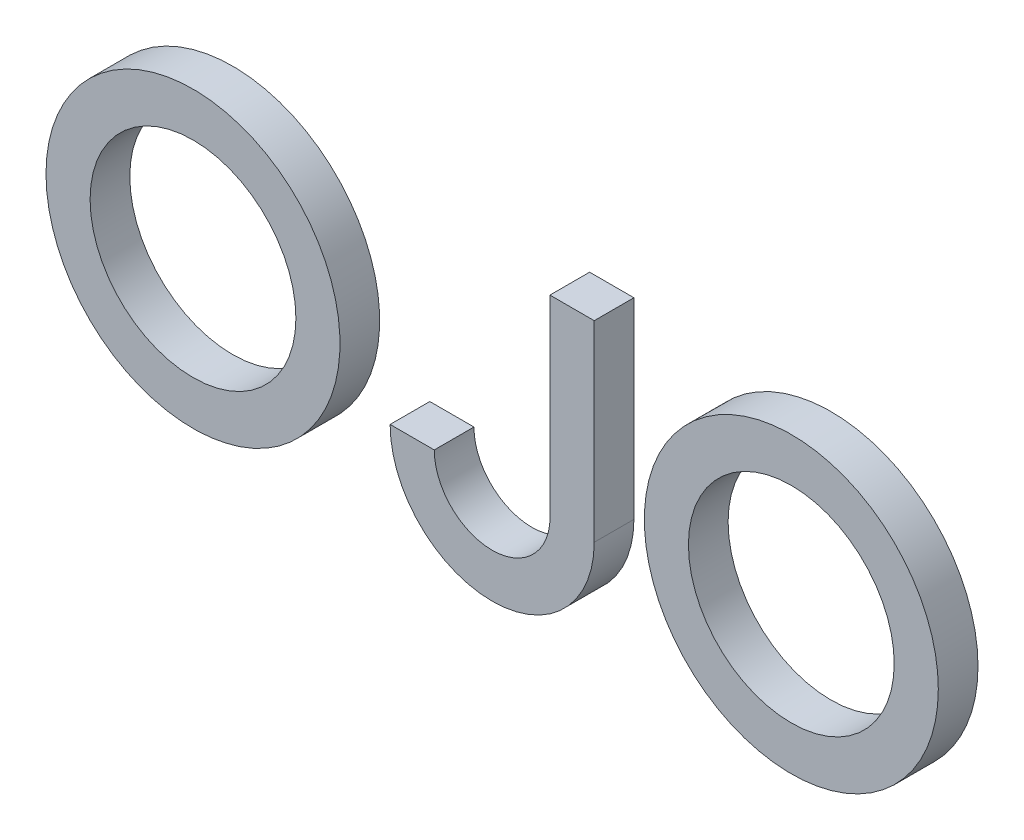
ISO-10303-21;
HEADER;
FILE_DESCRIPTION(('STEP AP214'),'2;1');
FILE_NAME('part.step','',(''),(''),'','','');
FILE_SCHEMA(('AUTOMOTIVE_DESIGN { 1 0 10303 214 1 1 1 1 }'));
ENDSEC;
DATA;
#1=APPLICATION_CONTEXT('core data for automotive mechanical design processes');
#2=APPLICATION_PROTOCOL_DEFINITION('international standard','automotive_design',2000,#1);
#3=PRODUCT_CONTEXT('',#1,'mechanical');
#4=PRODUCT('Part','Part','',(#3));
#5=PRODUCT_RELATED_PRODUCT_CATEGORY('part','',(#4));
#6=PRODUCT_DEFINITION_FORMATION('','',#4);
#7=PRODUCT_DEFINITION_CONTEXT('part definition',#1,'design');
#8=PRODUCT_DEFINITION('design','',#6,#7);
#9=PRODUCT_DEFINITION_SHAPE('','',#8);
#10=(LENGTH_UNIT() NAMED_UNIT(*) SI_UNIT(.MILLI.,.METRE.));
#11=(NAMED_UNIT(*) PLANE_ANGLE_UNIT() SI_UNIT($,.RADIAN.));
#12=(NAMED_UNIT(*) SI_UNIT($,.STERADIAN.) SOLID_ANGLE_UNIT());
#13=UNCERTAINTY_MEASURE_WITH_UNIT(LENGTH_MEASURE(1.E-05),#10,'distance_accuracy_value','');
#14=(GEOMETRIC_REPRESENTATION_CONTEXT(3) GLOBAL_UNCERTAINTY_ASSIGNED_CONTEXT((#13)) GLOBAL_UNIT_ASSIGNED_CONTEXT((#10,
#11,#12)) REPRESENTATION_CONTEXT('',''));
#15=CARTESIAN_POINT('',(0.,0.,0.));
#16=DIRECTION('',(0.,0.,1.));
#17=DIRECTION('',(1.,0.,0.));
#18=AXIS2_PLACEMENT_3D('',#15,#16,#17);
#19=CARTESIAN_POINT('',(-20.3518340191333,0.,2.7));
#20=DIRECTION('',(0.,0.,-1.));
#21=DIRECTION('',(-1.,0.,0.));
#22=AXIS2_PLACEMENT_3D('',#19,#20,#21);
#23=PLANE('',#22);
#24=CARTESIAN_POINT('',(-20.3518340191333,0.,2.7));
#25=DIRECTION('',(0.,0.,1.));
#26=DIRECTION('',(-1.,0.,0.));
#27=AXIS2_PLACEMENT_3D('',#24,#25,#26);
#28=CIRCLE('',#27,9.99999999999991);
#29=CARTESIAN_POINT('',(-30.3518340191332,0.,2.7));
#30=VERTEX_POINT('',#29);
#31=EDGE_CURVE('E11',#30,#30,#28,.T.);
#32=ORIENTED_EDGE('',*,*,#31,.T.);
#33=EDGE_LOOP('',(#32));
#34=FACE_BOUND('',#33,.T.);
#35=CARTESIAN_POINT('',(-20.3518340191333,0.,2.7));
#36=DIRECTION('',(0.,0.,1.));
#37=DIRECTION('',(-1.,0.,0.));
#38=AXIS2_PLACEMENT_3D('',#35,#36,#37);
#39=CIRCLE('',#38,6.99999999999994);
#40=CARTESIAN_POINT('',(-27.3518340191333,0.,2.7));
#41=VERTEX_POINT('',#40);
#42=EDGE_CURVE('E53',#41,#41,#39,.T.);
#43=ORIENTED_EDGE('',*,*,#42,.F.);
#44=EDGE_LOOP('',(#43));
#45=FACE_BOUND('',#44,.T.);
#46=ADVANCED_FACE('F42',(#34,#45),#23,.F.);
#47=CARTESIAN_POINT('',(-20.3518340191333,0.,0.));
#48=DIRECTION('',(0.,0.,-1.));
#49=DIRECTION('',(-1.,0.,0.));
#50=AXIS2_PLACEMENT_3D('',#47,#48,#49);
#51=PLANE('',#50);
#52=CARTESIAN_POINT('',(-20.3518340191333,0.,0.));
#53=DIRECTION('',(0.,0.,1.));
#54=DIRECTION('',(-1.,0.,0.));
#55=AXIS2_PLACEMENT_3D('',#52,#53,#54);
#56=CIRCLE('',#55,9.99999999999991);
#57=CARTESIAN_POINT('',(-30.3518340191332,0.,0.));
#58=VERTEX_POINT('',#57);
#59=EDGE_CURVE('E46',#58,#58,#56,.T.);
#60=ORIENTED_EDGE('',*,*,#59,.F.);
#61=EDGE_LOOP('',(#60));
#62=FACE_BOUND('',#61,.T.);
#63=CARTESIAN_POINT('',(-20.3518340191333,0.,0.));
#64=DIRECTION('',(0.,0.,1.));
#65=DIRECTION('',(-1.,0.,0.));
#66=AXIS2_PLACEMENT_3D('',#63,#64,#65);
#67=CIRCLE('',#66,6.99999999999994);
#68=CARTESIAN_POINT('',(-27.3518340191333,0.,0.));
#69=VERTEX_POINT('',#68);
#70=EDGE_CURVE('E55',#69,#69,#67,.T.);
#71=ORIENTED_EDGE('',*,*,#70,.T.);
#72=EDGE_LOOP('',(#71));
#73=FACE_BOUND('',#72,.T.);
#74=ADVANCED_FACE('F65',(#62,#73),#51,.T.);
#75=CARTESIAN_POINT('',(-20.3518340191333,0.,2.7));
#76=DIRECTION('',(0.,0.,-1.));
#77=DIRECTION('',(-1.,0.,0.));
#78=AXIS2_PLACEMENT_3D('',#75,#76,#77);
#79=CYLINDRICAL_SURFACE('',#78,9.99999999999991);
#80=ORIENTED_EDGE('',*,*,#31,.F.);
#81=EDGE_LOOP('',(#80));
#82=FACE_BOUND('',#81,.T.);
#83=ORIENTED_EDGE('',*,*,#59,.T.);
#84=EDGE_LOOP('',(#83));
#85=FACE_BOUND('',#84,.T.);
#86=ADVANCED_FACE('F44',(#82,#85),#79,.T.);
#87=CARTESIAN_POINT('',(-20.3518340191333,0.,2.7));
#88=DIRECTION('',(0.,0.,-1.));
#89=DIRECTION('',(-1.,0.,0.));
#90=AXIS2_PLACEMENT_3D('',#87,#88,#89);
#91=CYLINDRICAL_SURFACE('',#90,6.99999999999994);
#92=ORIENTED_EDGE('',*,*,#42,.T.);
#93=EDGE_LOOP('',(#92));
#94=FACE_BOUND('',#93,.T.);
#95=ORIENTED_EDGE('',*,*,#70,.F.);
#96=EDGE_LOOP('',(#95));
#97=FACE_BOUND('',#96,.T.);
#98=ADVANCED_FACE('F61',(#94,#97),#91,.F.);
#99=CLOSED_SHELL('',(#46,#74,#86,#98));
#100=MANIFOLD_SOLID_BREP('B2',#99);
#101=CARTESIAN_POINT('',(0.000959328068095289,-3.0569412516539,2.7));
#102=DIRECTION('',(0.,0.,-1.));
#103=DIRECTION('',(-1.,0.,0.));
#104=AXIS2_PLACEMENT_3D('',#101,#102,#103);
#105=CYLINDRICAL_SURFACE('',#104,3.93999935596175);
#106=CARTESIAN_POINT('',(0.000959328068095289,-3.0569412516539,0.));
#107=DIRECTION('',(0.,0.,-1.));
#108=DIRECTION('',(-1.,0.,0.));
#109=AXIS2_PLACEMENT_3D('',#106,#107,#108);
#110=CIRCLE('',#109,3.93999935596175);
#111=CARTESIAN_POINT('',(3.94095739595346,-3.05375533918861,0.));
#112=VERTEX_POINT('',#111);
#113=CARTESIAN_POINT('',(-3.93904002789369,-3.05694125165387,0.));
#114=VERTEX_POINT('',#113);
#115=EDGE_CURVE('E195',#112,#114,#110,.T.);
#116=ORIENTED_EDGE('',*,*,#115,.T.);
#117=DIRECTION('',(0.,0.,-1.));
#118=VECTOR('',#117,1.);
#119=CARTESIAN_POINT('',(-3.93904002789369,-3.05694125165387,2.7));
#120=LINE('',#119,#118);
#121=CARTESIAN_POINT('',(-3.93904002789369,-3.05694125165387,2.7));
#122=VERTEX_POINT('',#121);
#123=EDGE_CURVE('E40',#122,#114,#120,.T.);
#124=ORIENTED_EDGE('',*,*,#123,.F.);
#125=CARTESIAN_POINT('',(0.000959328068095289,-3.0569412516539,2.7));
#126=DIRECTION('',(0.,0.,-1.));
#127=DIRECTION('',(-1.,0.,0.));
#128=AXIS2_PLACEMENT_3D('',#125,#126,#127);
#129=CIRCLE('',#128,3.93999935596175);
#130=CARTESIAN_POINT('',(3.94095739595346,-3.05375533918861,2.7));
#131=VERTEX_POINT('',#130);
#132=EDGE_CURVE('E205',#131,#122,#129,.T.);
#133=ORIENTED_EDGE('',*,*,#132,.F.);
#134=DIRECTION('',(0.,0.,-1.));
#135=VECTOR('',#134,1.);
#136=CARTESIAN_POINT('',(3.94095739595346,-3.05375533918861,2.7));
#137=LINE('',#136,#135);
#138=EDGE_CURVE('E191',#131,#112,#137,.T.);
#139=ORIENTED_EDGE('',*,*,#138,.T.);
#140=EDGE_LOOP('',(#116,#124,#133,#139));
#141=FACE_BOUND('',#140,.T.);
#142=ADVANCED_FACE('F111',(#141),#105,.F.);
#143=CARTESIAN_POINT('',(-6.94209948655367,-3.05694125165387,2.7));
#144=DIRECTION('',(0.,-1.,0.));
#145=DIRECTION('',(0.,0.,-1.));
#146=AXIS2_PLACEMENT_3D('',#143,#144,#145);
#147=PLANE('',#146);
#148=DIRECTION('',(-1.,0.,0.));
#149=VECTOR('',#148,1.);
#150=CARTESIAN_POINT('',(-6.94209948655367,-3.05694125165387,0.));
#151=LINE('',#150,#149);
#152=CARTESIAN_POINT('',(-6.94209948655355,-3.0569412516539,0.));
#153=VERTEX_POINT('',#152);
#154=EDGE_CURVE('E198',#114,#153,#151,.T.);
#155=ORIENTED_EDGE('',*,*,#154,.T.);
#156=DIRECTION('',(0.,0.,-1.));
#157=VECTOR('',#156,1.);
#158=CARTESIAN_POINT('',(-6.94209948655355,-3.0569412516539,2.7));
#159=LINE('',#158,#157);
#160=CARTESIAN_POINT('',(-6.94209948655355,-3.0569412516539,2.7));
#161=VERTEX_POINT('',#160);
#162=EDGE_CURVE('E119',#161,#153,#159,.T.);
#163=ORIENTED_EDGE('',*,*,#162,.F.);
#164=DIRECTION('',(-1.,0.,0.));
#165=VECTOR('',#164,1.);
#166=CARTESIAN_POINT('',(-6.94209948655367,-3.05694125165387,2.7));
#167=LINE('',#166,#165);
#168=EDGE_CURVE('E164',#122,#161,#167,.T.);
#169=ORIENTED_EDGE('',*,*,#168,.F.);
#170=ORIENTED_EDGE('',*,*,#123,.T.);
#171=EDGE_LOOP('',(#155,#163,#169,#170));
#172=FACE_BOUND('',#171,.T.);
#173=ADVANCED_FACE('F229',(#172),#147,.F.);
#174=CARTESIAN_POINT('',(0.000959328068095289,-3.0569412516539,2.7));
#175=DIRECTION('',(0.,0.,-1.));
#176=DIRECTION('',(-1.,0.,0.));
#177=AXIS2_PLACEMENT_3D('',#174,#175,#176);
#178=CYLINDRICAL_SURFACE('',#177,6.94305881462165);
#179=CARTESIAN_POINT('',(0.000959328068095289,-3.0569412516539,0.));
#180=DIRECTION('',(0.,0.,1.));
#181=DIRECTION('',(-1.,0.,0.));
#182=AXIS2_PLACEMENT_3D('',#179,#180,#181);
#183=CIRCLE('',#182,6.94305881462165);
#184=CARTESIAN_POINT('',(6.94401814268963,-3.05694125165365,0.));
#185=VERTEX_POINT('',#184);
#186=EDGE_CURVE('E200',#153,#185,#183,.T.);
#187=ORIENTED_EDGE('',*,*,#186,.T.);
#188=DIRECTION('',(0.,0.,-1.));
#189=VECTOR('',#188,1.);
#190=CARTESIAN_POINT('',(6.94401814268963,-3.05694125165365,2.7));
#191=LINE('',#190,#189);
#192=CARTESIAN_POINT('',(6.94401814268963,-3.05694125165365,2.7));
#193=VERTEX_POINT('',#192);
#194=EDGE_CURVE('E186',#193,#185,#191,.T.);
#195=ORIENTED_EDGE('',*,*,#194,.F.);
#196=CARTESIAN_POINT('',(0.000959328068095289,-3.0569412516539,2.7));
#197=DIRECTION('',(0.,0.,1.));
#198=DIRECTION('',(-1.,0.,0.));
#199=AXIS2_PLACEMENT_3D('',#196,#197,#198);
#200=CIRCLE('',#199,6.94305881462165);
#201=EDGE_CURVE('E177',#161,#193,#200,.T.);
#202=ORIENTED_EDGE('',*,*,#201,.F.);
#203=ORIENTED_EDGE('',*,*,#162,.T.);
#204=EDGE_LOOP('',(#187,#195,#202,#203));
#205=FACE_BOUND('',#204,.T.);
#206=ADVANCED_FACE('F211',(#205),#178,.T.);
#207=CARTESIAN_POINT('',(6.94401814268963,10.0000000005211,2.7));
#208=DIRECTION('',(-1.,0.,0.));
#209=DIRECTION('',(0.,0.,1.));
#210=AXIS2_PLACEMENT_3D('',#207,#208,#209);
#211=PLANE('',#210);
#212=DIRECTION('',(0.,1.,0.));
#213=VECTOR('',#212,1.);
#214=CARTESIAN_POINT('',(6.94401814268963,10.0000000005211,0.));
#215=LINE('',#214,#213);
#216=CARTESIAN_POINT('',(6.94401814268963,10.0000000005211,0.));
#217=VERTEX_POINT('',#216);
#218=EDGE_CURVE('E185',#185,#217,#215,.T.);
#219=ORIENTED_EDGE('',*,*,#218,.T.);
#220=DIRECTION('',(0.,0.,-1.));
#221=VECTOR('',#220,1.);
#222=CARTESIAN_POINT('',(6.94401814268963,10.0000000005211,2.7));
#223=LINE('',#222,#221);
#224=CARTESIAN_POINT('',(6.94401814268963,10.0000000005211,2.7));
#225=VERTEX_POINT('',#224);
#226=EDGE_CURVE('E182',#225,#217,#223,.T.);
#227=ORIENTED_EDGE('',*,*,#226,.F.);
#228=DIRECTION('',(0.,1.,0.));
#229=VECTOR('',#228,1.);
#230=CARTESIAN_POINT('',(6.94401814268963,10.0000000005211,2.7));
#231=LINE('',#230,#229);
#232=EDGE_CURVE('E171',#193,#225,#231,.T.);
#233=ORIENTED_EDGE('',*,*,#232,.F.);
#234=ORIENTED_EDGE('',*,*,#194,.T.);
#235=EDGE_LOOP('',(#219,#227,#233,#234));
#236=FACE_BOUND('',#235,.T.);
#237=ADVANCED_FACE('F183',(#236),#211,.F.);
#238=CARTESIAN_POINT('',(3.93040202990091,10.0000000005211,2.7));
#239=DIRECTION('',(0.,-1.,0.));
#240=DIRECTION('',(0.,0.,-1.));
#241=AXIS2_PLACEMENT_3D('',#238,#239,#240);
#242=PLANE('',#241);
#243=DIRECTION('',(-1.,0.,0.));
#244=VECTOR('',#243,1.);
#245=CARTESIAN_POINT('',(3.93040202990091,10.0000000005211,0.));
#246=LINE('',#245,#244);
#247=CARTESIAN_POINT('',(3.93040202990091,10.0000000005211,0.));
#248=VERTEX_POINT('',#247);
#249=EDGE_CURVE('E150',#217,#248,#246,.T.);
#250=ORIENTED_EDGE('',*,*,#249,.T.);
#251=DIRECTION('',(0.,0.,-1.));
#252=VECTOR('',#251,1.);
#253=CARTESIAN_POINT('',(3.93040202990091,10.0000000005211,2.7));
#254=LINE('',#253,#252);
#255=CARTESIAN_POINT('',(3.93040202990091,10.0000000005211,2.7));
#256=VERTEX_POINT('',#255);
#257=EDGE_CURVE('E187',#256,#248,#254,.T.);
#258=ORIENTED_EDGE('',*,*,#257,.F.);
#259=DIRECTION('',(-1.,0.,0.));
#260=VECTOR('',#259,1.);
#261=CARTESIAN_POINT('',(3.93040202990091,10.0000000005211,2.7));
#262=LINE('',#261,#260);
#263=EDGE_CURVE('E175',#225,#256,#262,.T.);
#264=ORIENTED_EDGE('',*,*,#263,.F.);
#265=ORIENTED_EDGE('',*,*,#226,.T.);
#266=EDGE_LOOP('',(#250,#258,#264,#265));
#267=FACE_BOUND('',#266,.T.);
#268=ADVANCED_FACE('F189',(#267),#242,.F.);
#269=CARTESIAN_POINT('',(3.93040202990091,10.0000000005211,2.7));
#270=DIRECTION('',(0.999999673077018,0.000808607356815051,0.));
#271=DIRECTION('',(-0.000808607356815051,0.999999673077018,0.));
#272=AXIS2_PLACEMENT_3D('',#269,#270,#271);
#273=PLANE('',#272);
#274=DIRECTION('',(0.000808607356815051,-0.999999673077018,0.));
#275=VECTOR('',#274,1.);
#276=CARTESIAN_POINT('',(3.93040202990091,10.0000000005211,0.));
#277=LINE('',#276,#275);
#278=EDGE_CURVE('E156',#248,#112,#277,.T.);
#279=ORIENTED_EDGE('',*,*,#278,.T.);
#280=ORIENTED_EDGE('',*,*,#138,.F.);
#281=DIRECTION('',(0.000808607356815051,-0.999999673077018,0.));
#282=VECTOR('',#281,1.);
#283=CARTESIAN_POINT('',(3.93040202990091,10.0000000005211,2.7));
#284=LINE('',#283,#282);
#285=EDGE_CURVE('E127',#256,#131,#284,.T.);
#286=ORIENTED_EDGE('',*,*,#285,.F.);
#287=ORIENTED_EDGE('',*,*,#257,.T.);
#288=EDGE_LOOP('',(#279,#280,#286,#287));
#289=FACE_BOUND('',#288,.T.);
#290=ADVANCED_FACE('F218',(#289),#273,.F.);
#291=CARTESIAN_POINT('',(0.000959328068095289,-3.0569412516539,2.7));
#292=DIRECTION('',(0.,0.,-1.));
#293=DIRECTION('',(-1.,0.,0.));
#294=AXIS2_PLACEMENT_3D('',#291,#292,#293);
#295=PLANE('',#294);
#296=ORIENTED_EDGE('',*,*,#132,.T.);
#297=ORIENTED_EDGE('',*,*,#168,.T.);
#298=ORIENTED_EDGE('',*,*,#201,.T.);
#299=ORIENTED_EDGE('',*,*,#232,.T.);
#300=ORIENTED_EDGE('',*,*,#263,.T.);
#301=ORIENTED_EDGE('',*,*,#285,.T.);
#302=EDGE_LOOP('',(#296,#297,#298,#299,#300,#301));
#303=FACE_BOUND('',#302,.T.);
#304=ADVANCED_FACE('F173',(#303),#295,.F.);
#305=CARTESIAN_POINT('',(0.000959328068095289,-3.0569412516539,0.));
#306=DIRECTION('',(0.,0.,-1.));
#307=DIRECTION('',(-1.,0.,0.));
#308=AXIS2_PLACEMENT_3D('',#305,#306,#307);
#309=PLANE('',#308);
#310=ORIENTED_EDGE('',*,*,#115,.F.);
#311=ORIENTED_EDGE('',*,*,#278,.F.);
#312=ORIENTED_EDGE('',*,*,#249,.F.);
#313=ORIENTED_EDGE('',*,*,#218,.F.);
#314=ORIENTED_EDGE('',*,*,#186,.F.);
#315=ORIENTED_EDGE('',*,*,#154,.F.);
#316=EDGE_LOOP('',(#310,#311,#312,#313,#314,#315));
#317=FACE_BOUND('',#316,.T.);
#318=ADVANCED_FACE('F214',(#317),#309,.T.);
#319=CLOSED_SHELL('',(#142,#173,#206,#237,#268,#290,#304,#318));
#320=MANIFOLD_SOLID_BREP('B6',#319);
#321=CARTESIAN_POINT('',(20.3518340191331,2.77555756156289E-13,2.7));
#322=DIRECTION('',(0.,0.,1.));
#323=DIRECTION('',(1.,0.,0.));
#324=AXIS2_PLACEMENT_3D('',#321,#322,#323);
#325=PLANE('',#324);
#326=CARTESIAN_POINT('',(20.3518340191331,2.77555756156289E-13,2.7));
#327=DIRECTION('',(0.,0.,1.));
#328=DIRECTION('',(1.,0.,0.));
#329=AXIS2_PLACEMENT_3D('',#326,#327,#328);
#330=CIRCLE('',#329,10.0000000000001);
#331=CARTESIAN_POINT('',(30.3518340191332,2.77555756156289E-13,2.7));
#332=VERTEX_POINT('',#331);
#333=EDGE_CURVE('E110',#332,#332,#330,.T.);
#334=ORIENTED_EDGE('',*,*,#333,.T.);
#335=EDGE_LOOP('',(#334));
#336=FACE_BOUND('',#335,.T.);
#337=CARTESIAN_POINT('',(20.3518340191331,2.77555756156289E-13,2.7));
#338=DIRECTION('',(0.,0.,1.));
#339=DIRECTION('',(1.,0.,0.));
#340=AXIS2_PLACEMENT_3D('',#337,#338,#339);
#341=CIRCLE('',#340,7.00000000000004);
#342=CARTESIAN_POINT('',(27.3518340191331,2.77555756156289E-13,2.7));
#343=VERTEX_POINT('',#342);
#344=EDGE_CURVE('E298',#343,#343,#341,.T.);
#345=ORIENTED_EDGE('',*,*,#344,.F.);
#346=EDGE_LOOP('',(#345));
#347=FACE_BOUND('',#346,.T.);
#348=ADVANCED_FACE('F287',(#336,#347),#325,.T.);
#349=CARTESIAN_POINT('',(20.3518340191331,2.77555756156289E-13,0.));
#350=DIRECTION('',(0.,0.,1.));
#351=DIRECTION('',(1.,0.,0.));
#352=AXIS2_PLACEMENT_3D('',#349,#350,#351);
#353=PLANE('',#352);
#354=CARTESIAN_POINT('',(20.3518340191331,2.77555756156289E-13,0.));
#355=DIRECTION('',(0.,0.,1.));
#356=DIRECTION('',(1.,0.,0.));
#357=AXIS2_PLACEMENT_3D('',#354,#355,#356);
#358=CIRCLE('',#357,10.0000000000001);
#359=CARTESIAN_POINT('',(30.3518340191332,2.77555756156289E-13,0.));
#360=VERTEX_POINT('',#359);
#361=EDGE_CURVE('E291',#360,#360,#358,.T.);
#362=ORIENTED_EDGE('',*,*,#361,.F.);
#363=EDGE_LOOP('',(#362));
#364=FACE_BOUND('',#363,.T.);
#365=CARTESIAN_POINT('',(20.3518340191331,2.77555756156289E-13,0.));
#366=DIRECTION('',(0.,0.,1.));
#367=DIRECTION('',(1.,0.,0.));
#368=AXIS2_PLACEMENT_3D('',#365,#366,#367);
#369=CIRCLE('',#368,7.00000000000004);
#370=CARTESIAN_POINT('',(27.3518340191331,2.77555756156289E-13,0.));
#371=VERTEX_POINT('',#370);
#372=EDGE_CURVE('E300',#371,#371,#369,.T.);
#373=ORIENTED_EDGE('',*,*,#372,.T.);
#374=EDGE_LOOP('',(#373));
#375=FACE_BOUND('',#374,.T.);
#376=ADVANCED_FACE('F310',(#364,#375),#353,.F.);
#377=CARTESIAN_POINT('',(20.3518340191331,2.77555756156289E-13,2.7));
#378=DIRECTION('',(0.,0.,-1.));
#379=DIRECTION('',(-1.,0.,0.));
#380=AXIS2_PLACEMENT_3D('',#377,#378,#379);
#381=CYLINDRICAL_SURFACE('',#380,10.0000000000001);
#382=ORIENTED_EDGE('',*,*,#333,.F.);
#383=EDGE_LOOP('',(#382));
#384=FACE_BOUND('',#383,.T.);
#385=ORIENTED_EDGE('',*,*,#361,.T.);
#386=EDGE_LOOP('',(#385));
#387=FACE_BOUND('',#386,.T.);
#388=ADVANCED_FACE('F289',(#384,#387),#381,.T.);
#389=CARTESIAN_POINT('',(20.3518340191331,2.77555756156289E-13,2.7));
#390=DIRECTION('',(0.,0.,-1.));
#391=DIRECTION('',(-1.,0.,0.));
#392=AXIS2_PLACEMENT_3D('',#389,#390,#391);
#393=CYLINDRICAL_SURFACE('',#392,7.00000000000004);
#394=ORIENTED_EDGE('',*,*,#344,.T.);
#395=EDGE_LOOP('',(#394));
#396=FACE_BOUND('',#395,.T.);
#397=ORIENTED_EDGE('',*,*,#372,.F.);
#398=EDGE_LOOP('',(#397));
#399=FACE_BOUND('',#398,.T.);
#400=ADVANCED_FACE('F306',(#396,#399),#393,.F.);
#401=CLOSED_SHELL('',(#348,#376,#388,#400));
#402=MANIFOLD_SOLID_BREP('B34',#401);
#403=ADVANCED_BREP_SHAPE_REPRESENTATION('',(#18,#100,#320,#402),#14);
#404=SHAPE_DEFINITION_REPRESENTATION(#9,#403);
ENDSEC;
END-ISO-10303-21;
